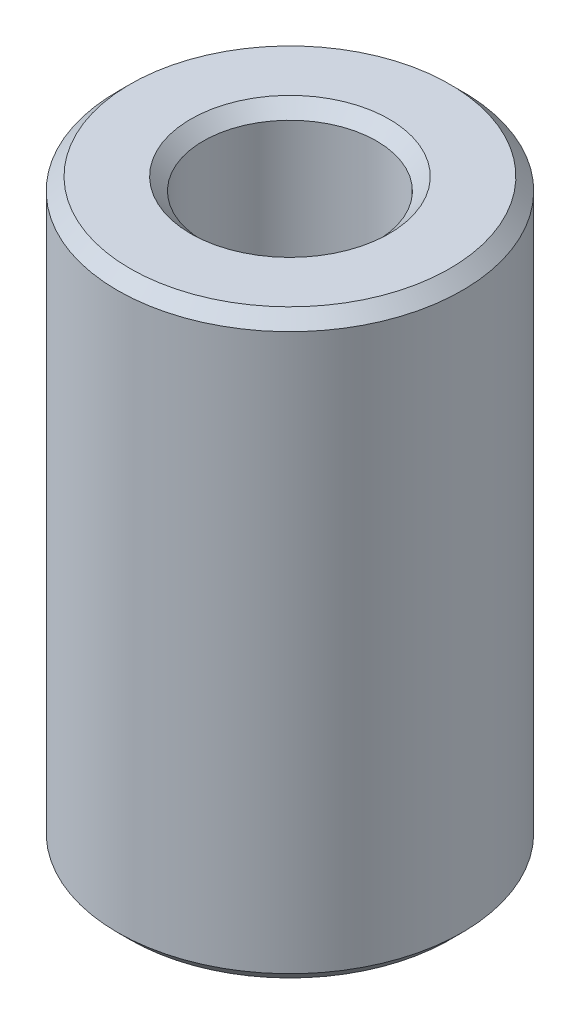
ISO-10303-21;
HEADER;
FILE_DESCRIPTION(('STEP AP214'),'2;1');
FILE_NAME('part.step','',(''),(''),'','','');
FILE_SCHEMA(('AUTOMOTIVE_DESIGN { 1 0 10303 214 1 1 1 1 }'));
ENDSEC;
DATA;
#1=APPLICATION_CONTEXT('core data for automotive mechanical design processes');
#2=APPLICATION_PROTOCOL_DEFINITION('international standard','automotive_design',2000,#1);
#3=PRODUCT_CONTEXT('',#1,'mechanical');
#4=PRODUCT('Part','Part','',(#3));
#5=PRODUCT_RELATED_PRODUCT_CATEGORY('part','',(#4));
#6=PRODUCT_DEFINITION_FORMATION('','',#4);
#7=PRODUCT_DEFINITION_CONTEXT('part definition',#1,'design');
#8=PRODUCT_DEFINITION('design','',#6,#7);
#9=PRODUCT_DEFINITION_SHAPE('','',#8);
#10=(LENGTH_UNIT() NAMED_UNIT(*) SI_UNIT(.MILLI.,.METRE.));
#11=(NAMED_UNIT(*) PLANE_ANGLE_UNIT() SI_UNIT($,.RADIAN.));
#12=(NAMED_UNIT(*) SI_UNIT($,.STERADIAN.) SOLID_ANGLE_UNIT());
#13=UNCERTAINTY_MEASURE_WITH_UNIT(LENGTH_MEASURE(1.E-05),#10,'distance_accuracy_value','');
#14=(GEOMETRIC_REPRESENTATION_CONTEXT(3) GLOBAL_UNCERTAINTY_ASSIGNED_CONTEXT((#13)) GLOBAL_UNIT_ASSIGNED_CONTEXT((#10,
#11,#12)) REPRESENTATION_CONTEXT('',''));
#15=CARTESIAN_POINT('',(0.,0.,0.));
#16=DIRECTION('',(0.,0.,1.));
#17=DIRECTION('',(1.,0.,0.));
#18=AXIS2_PLACEMENT_3D('',#15,#16,#17);
#19=CARTESIAN_POINT('',(0.,126.442121757997,0.));
#20=DIRECTION('',(0.,-1.,0.));
#21=DIRECTION('',(0.,0.,-1.));
#22=AXIS2_PLACEMENT_3D('',#19,#20,#21);
#23=CYLINDRICAL_SURFACE('',#22,37.5);
#24=CARTESIAN_POINT('',(0.,2.74460493182742,0.));
#25=DIRECTION('',(0.,1.,0.));
#26=DIRECTION('',(0.,0.,1.));
#27=AXIS2_PLACEMENT_3D('',#24,#25,#26);
#28=CIRCLE('',#27,37.5);
#29=CARTESIAN_POINT('',(0.,2.74460493182742,37.5));
#30=VERTEX_POINT('',#29);
#31=EDGE_CURVE('E10',#30,#30,#28,.T.);
#32=ORIENTED_EDGE('',*,*,#31,.T.);
#33=EDGE_LOOP('',(#32));
#34=FACE_BOUND('',#33,.T.);
#35=CARTESIAN_POINT('',(0.,123.697516826169,0.));
#36=DIRECTION('',(0.,1.,0.));
#37=DIRECTION('',(0.,0.,1.));
#38=AXIS2_PLACEMENT_3D('',#35,#36,#37);
#39=CIRCLE('',#38,37.5);
#40=CARTESIAN_POINT('',(0.,123.697516826169,37.5));
#41=VERTEX_POINT('',#40);
#42=EDGE_CURVE('E50',#41,#41,#39,.F.);
#43=ORIENTED_EDGE('',*,*,#42,.T.);
#44=EDGE_LOOP('',(#43));
#45=FACE_BOUND('',#44,.T.);
#46=ADVANCED_FACE('F39',(#34,#45),#23,.T.);
#47=CARTESIAN_POINT('',(0.,126.442121757997,0.));
#48=DIRECTION('',(0.,1.,0.));
#49=DIRECTION('',(0.,0.,1.));
#50=AXIS2_PLACEMENT_3D('',#47,#48,#49);
#51=PLANE('',#50);
#52=CARTESIAN_POINT('',(0.,126.442121757997,0.));
#53=DIRECTION('',(0.,1.,0.));
#54=DIRECTION('',(0.,0.,1.));
#55=AXIS2_PLACEMENT_3D('',#52,#53,#54);
#56=CIRCLE('',#55,21.5910273843919);
#57=CARTESIAN_POINT('',(0.,126.442121757997,21.5910273843919));
#58=VERTEX_POINT('',#57);
#59=EDGE_CURVE('E58',#58,#58,#56,.F.);
#60=ORIENTED_EDGE('',*,*,#59,.T.);
#61=EDGE_LOOP('',(#60));
#62=FACE_BOUND('',#61,.T.);
#63=CARTESIAN_POINT('',(0.,126.442121757997,0.));
#64=DIRECTION('',(0.,1.,0.));
#65=DIRECTION('',(0.,0.,1.));
#66=AXIS2_PLACEMENT_3D('',#63,#64,#65);
#67=CIRCLE('',#66,34.7553950681726);
#68=CARTESIAN_POINT('',(0.,126.442121757997,34.7553950681726));
#69=VERTEX_POINT('',#68);
#70=EDGE_CURVE('E61',#69,#69,#67,.T.);
#71=ORIENTED_EDGE('',*,*,#70,.T.);
#72=EDGE_LOOP('',(#71));
#73=FACE_BOUND('',#72,.T.);
#74=ADVANCED_FACE('F88',(#62,#73),#51,.T.);
#75=CARTESIAN_POINT('',(0.,0.,0.));
#76=DIRECTION('',(0.,1.,0.));
#77=DIRECTION('',(0.,0.,1.));
#78=AXIS2_PLACEMENT_3D('',#75,#76,#77);
#79=PLANE('',#78);
#80=CARTESIAN_POINT('',(0.,0.,0.));
#81=DIRECTION('',(0.,1.,0.));
#82=DIRECTION('',(0.,0.,1.));
#83=AXIS2_PLACEMENT_3D('',#80,#81,#82);
#84=CIRCLE('',#83,21.5910273843919);
#85=CARTESIAN_POINT('',(0.,0.,-21.5910273843919));
#86=VERTEX_POINT('',#85);
#87=EDGE_CURVE('E51',#86,#86,#84,.T.);
#88=ORIENTED_EDGE('',*,*,#87,.T.);
#89=EDGE_LOOP('',(#88));
#90=FACE_BOUND('',#89,.T.);
#91=CARTESIAN_POINT('',(0.,0.,0.));
#92=DIRECTION('',(0.,1.,0.));
#93=DIRECTION('',(0.,0.,1.));
#94=AXIS2_PLACEMENT_3D('',#91,#92,#93);
#95=CIRCLE('',#94,34.7553950681726);
#96=CARTESIAN_POINT('',(0.,0.,34.7553950681726));
#97=VERTEX_POINT('',#96);
#98=EDGE_CURVE('E54',#97,#97,#95,.F.);
#99=ORIENTED_EDGE('',*,*,#98,.T.);
#100=EDGE_LOOP('',(#99));
#101=FACE_BOUND('',#100,.T.);
#102=ADVANCED_FACE('F83',(#90,#101),#79,.F.);
#103=CARTESIAN_POINT('',(0.,126.442121757997,0.));
#104=DIRECTION('',(0.,-1.,0.));
#105=DIRECTION('',(0.,0.,-1.));
#106=AXIS2_PLACEMENT_3D('',#103,#104,#105);
#107=CYLINDRICAL_SURFACE('',#106,18.8464224525645);
#108=CARTESIAN_POINT('',(0.,123.697516826169,0.));
#109=DIRECTION('',(0.,1.,0.));
#110=DIRECTION('',(0.,0.,1.));
#111=AXIS2_PLACEMENT_3D('',#108,#109,#110);
#112=CIRCLE('',#111,18.8464224525645);
#113=CARTESIAN_POINT('',(0.,123.697516826169,18.8464224525645));
#114=VERTEX_POINT('',#113);
#115=EDGE_CURVE('E67',#114,#114,#112,.T.);
#116=ORIENTED_EDGE('',*,*,#115,.T.);
#117=EDGE_LOOP('',(#116));
#118=FACE_BOUND('',#117,.T.);
#119=CARTESIAN_POINT('',(0.,2.74460493182743,0.));
#120=DIRECTION('',(0.,1.,0.));
#121=DIRECTION('',(0.,0.,1.));
#122=AXIS2_PLACEMENT_3D('',#119,#120,#121);
#123=CIRCLE('',#122,18.8464224525645);
#124=CARTESIAN_POINT('',(0.,2.74460493182743,-18.8464224525645));
#125=VERTEX_POINT('',#124);
#126=EDGE_CURVE('E69',#125,#125,#123,.F.);
#127=ORIENTED_EDGE('',*,*,#126,.T.);
#128=EDGE_LOOP('',(#127));
#129=FACE_BOUND('',#128,.T.);
#130=ADVANCED_FACE('F71',(#118,#129),#107,.F.);
#131=CARTESIAN_POINT('',(0.,123.697516826169,0.));
#132=DIRECTION('',(0.,1.,0.));
#133=DIRECTION('',(0.,0.,1.));
#134=AXIS2_PLACEMENT_3D('',#131,#132,#133);
#135=CONICAL_SURFACE('',#134,18.8464224525645,0.785398163397449);
#136=ORIENTED_EDGE('',*,*,#59,.F.);
#137=EDGE_LOOP('',(#136));
#138=FACE_BOUND('',#137,.T.);
#139=ORIENTED_EDGE('',*,*,#115,.F.);
#140=EDGE_LOOP('',(#139));
#141=FACE_BOUND('',#140,.T.);
#142=ADVANCED_FACE('F77',(#138,#141),#135,.F.);
#143=CARTESIAN_POINT('',(0.,0.,0.));
#144=DIRECTION('',(0.,-1.,0.));
#145=DIRECTION('',(0.,0.,-1.));
#146=AXIS2_PLACEMENT_3D('',#143,#144,#145);
#147=CONICAL_SURFACE('',#146,21.5910273843919,0.785398163397446);
#148=CARTESIAN_POINT('',(0.,2.74460493182743,-18.8464224525645));
#149=CARTESIAN_POINT('',(0.,2.7160152971209,-18.875012087271));
#150=CARTESIAN_POINT('',(0.,2.68742566241436,-18.9036017219776));
#151=CARTESIAN_POINT('',(0.,2.63024639300129,-18.9607809913906));
#152=CARTESIAN_POINT('',(0.,2.60165675829475,-18.9893706260972));
#153=CARTESIAN_POINT('',(0.,2.54447748888168,-19.0465498955102));
#154=CARTESIAN_POINT('',(0.,2.51588785417515,-19.0751395302168));
#155=CARTESIAN_POINT('',(0.,2.45870858476207,-19.1323187996298));
#156=CARTESIAN_POINT('',(0.,2.43011895005554,-19.1609084343364));
#157=CARTESIAN_POINT('',(0.,2.37293968064247,-19.2180877037495));
#158=CARTESIAN_POINT('',(0.,2.34435004593593,-19.246677338456));
#159=CARTESIAN_POINT('',(0.,2.28717077652286,-19.3038566078691));
#160=CARTESIAN_POINT('',(0.,2.25858114181632,-19.3324462425756));
#161=CARTESIAN_POINT('',(0.,2.20140187240325,-19.3896255119887));
#162=CARTESIAN_POINT('',(0.,2.17281223769672,-19.4182151466952));
#163=CARTESIAN_POINT('',(0.,2.11563296828364,-19.4753944161083));
#164=CARTESIAN_POINT('',(0.,2.08704333357711,-19.5039840508148));
#165=CARTESIAN_POINT('',(0.,2.02986406416404,-19.5611633202279));
#166=CARTESIAN_POINT('',(0.,2.0012744294575,-19.5897529549344));
#167=CARTESIAN_POINT('',(0.,1.94409516004443,-19.6469322243475));
#168=CARTESIAN_POINT('',(0.,1.91550552533789,-19.675521859054));
#169=CARTESIAN_POINT('',(0.,1.85832625592482,-19.7327011284671));
#170=CARTESIAN_POINT('',(0.,1.82973662121829,-19.7612907631736));
#171=CARTESIAN_POINT('',(0.,1.77255735180522,-19.8184700325867));
#172=CARTESIAN_POINT('',(0.,1.74396771709868,-19.8470596672932));
#173=CARTESIAN_POINT('',(0.,1.68678844768561,-19.9042389367063));
#174=CARTESIAN_POINT('',(0.,1.65819881297907,-19.9328285714128));
#175=CARTESIAN_POINT('',(0.,1.601019543566,-19.9900078408259));
#176=CARTESIAN_POINT('',(0.,1.57242990885947,-20.0185974755324));
#177=CARTESIAN_POINT('',(0.,1.51525063944639,-20.0757767449455));
#178=CARTESIAN_POINT('',(0.,1.48666100473986,-20.1043663796521));
#179=CARTESIAN_POINT('',(0.,1.42948173532679,-20.1615456490651));
#180=CARTESIAN_POINT('',(0.,1.40089210062025,-20.1901352837717));
#181=CARTESIAN_POINT('',(0.,1.34371283120718,-20.2473145531847));
#182=CARTESIAN_POINT('',(0.,1.31512319650064,-20.2759041878913));
#183=CARTESIAN_POINT('',(0.,1.25794392708757,-20.3330834573043));
#184=CARTESIAN_POINT('',(0.,1.22935429238104,-20.3616730920109));
#185=CARTESIAN_POINT('',(0.,1.17217502296797,-20.4188523614239));
#186=CARTESIAN_POINT('',(0.,1.14358538826143,-20.4474419961305));
#187=CARTESIAN_POINT('',(0.,1.08640611884836,-20.5046212655436));
#188=CARTESIAN_POINT('',(0.,1.05781648414182,-20.5332109002501));
#189=CARTESIAN_POINT('',(0.,1.00063721472875,-20.5903901696632));
#190=CARTESIAN_POINT('',(0.,0.972047580022216,-20.6189798043697));
#191=CARTESIAN_POINT('',(0.,0.914868310609144,-20.6761590737828));
#192=CARTESIAN_POINT('',(0.,0.886278675902609,-20.7047487084893));
#193=CARTESIAN_POINT('',(0.,0.829099406489537,-20.7619279779024));
#194=CARTESIAN_POINT('',(0.,0.800509771783001,-20.7905176126089));
#195=CARTESIAN_POINT('',(0.,0.743330502369929,-20.847696882022));
#196=CARTESIAN_POINT('',(0.,0.714740867663394,-20.8762865167285));
#197=CARTESIAN_POINT('',(0.,0.657561598250323,-20.9334657861416));
#198=CARTESIAN_POINT('',(0.,0.628971963543786,-20.9620554208481));
#199=CARTESIAN_POINT('',(0.,0.571792694130715,-21.0192346902612));
#200=CARTESIAN_POINT('',(0.,0.543203059424179,-21.0478243249677));
#201=CARTESIAN_POINT('',(0.,0.486023790011108,-21.1050035943808));
#202=CARTESIAN_POINT('',(0.,0.457434155304572,-21.1335932290873));
#203=CARTESIAN_POINT('',(0.,0.4002548858915,-21.1907724985004));
#204=CARTESIAN_POINT('',(0.,0.371665251184964,-21.2193621332069));
#205=CARTESIAN_POINT('',(0.,0.314485981771893,-21.27654140262));
#206=CARTESIAN_POINT('',(0.,0.285896347065358,-21.3051310373266));
#207=CARTESIAN_POINT('',(0.,0.228717077652286,-21.3623103067396));
#208=CARTESIAN_POINT('',(0.,0.20012744294575,-21.3908999414462));
#209=CARTESIAN_POINT('',(0.,0.142948173532678,-21.4480792108592));
#210=CARTESIAN_POINT('',(0.,0.114358538826143,-21.4766688455658));
#211=CARTESIAN_POINT('',(0.,0.0571792694130721,-21.5338481149788));
#212=CARTESIAN_POINT('',(0.,0.0285896347065367,-21.5624377496854));
#213=CARTESIAN_POINT('',(0.,0.,-21.5910273843919));
#214=B_SPLINE_CURVE_WITH_KNOTS('',3,(#148,#149,#150,#151,#152,#153,#154,#155,#156,#157,#158,
#159,#160,#161,#162,#163,#164,#165,#166,#167,#168,#169,#170,#171,#172,#173,#174,#175,#176,#177,
#178,#179,#180,#181,#182,#183,#184,#185,#186,#187,#188,#189,#190,#191,#192,#193,#194,#195,#196,
#197,#198,#199,#200,#201,#202,#203,#204,#205,#206,#207,#208,#209,#210,#211,#212,#213),
.UNSPECIFIED.,.F.,.F.,(4,2,2,2,2,2,2,2,2,2,2,2,2,2,2,2,2,2,2,2,2,2,2,2,2,2,2,2,2,2,2,2,4),(0.,
0.121295547435827,0.242591094871652,0.363886642307477,0.485182189743305,0.60647773717913,
0.727773284614957,0.849068832050782,0.970364379486607,1.09165992692243,1.21295547435826,
1.33425102179409,1.45554656922991,1.57684211666574,1.69813766410156,1.81943321153739,
1.94072875897322,2.06202430640904,2.18331985384487,2.30461540128069,2.42591094871652,
2.54720649615235,2.66850204358817,2.789797591024,2.91109313845982,3.03238868589565,
3.15368423333148,3.2749797807673,3.39627532820313,3.51757087563895,3.63886642307478,
3.76016197051061,3.88145751794643),.UNSPECIFIED.);
#215=EDGE_CURVE('BSEAM73',#125,#86,#214,.T.);
#216=ORIENTED_EDGE('',*,*,#126,.F.);
#217=ORIENTED_EDGE('',*,*,#87,.F.);
#218=ORIENTED_EDGE('',*,*,#215,.T.);
#219=ORIENTED_EDGE('',*,*,#215,.F.);
#220=EDGE_LOOP('',(#216,#218,#217,#219));
#221=FACE_BOUND('',#220,.T.);
#222=ADVANCED_FACE('F73',(#221),#147,.F.);
#223=CARTESIAN_POINT('',(0.,2.74460493182742,0.));
#224=DIRECTION('',(0.,1.,0.));
#225=DIRECTION('',(0.,0.,1.));
#226=AXIS2_PLACEMENT_3D('',#223,#224,#225);
#227=CONICAL_SURFACE('',#226,37.5,0.785398163397451);
#228=ORIENTED_EDGE('',*,*,#98,.F.);
#229=EDGE_LOOP('',(#228));
#230=FACE_BOUND('',#229,.T.);
#231=ORIENTED_EDGE('',*,*,#31,.F.);
#232=EDGE_LOOP('',(#231));
#233=FACE_BOUND('',#232,.T.);
#234=ADVANCED_FACE('F76',(#230,#233),#227,.T.);
#235=CARTESIAN_POINT('',(0.,126.442121757997,0.));
#236=DIRECTION('',(0.,-1.,0.));
#237=DIRECTION('',(0.,0.,-1.));
#238=AXIS2_PLACEMENT_3D('',#235,#236,#237);
#239=CONICAL_SURFACE('',#238,34.7553950681726,0.785398163397441);
#240=ORIENTED_EDGE('',*,*,#42,.F.);
#241=EDGE_LOOP('',(#240));
#242=FACE_BOUND('',#241,.T.);
#243=ORIENTED_EDGE('',*,*,#70,.F.);
#244=EDGE_LOOP('',(#243));
#245=FACE_BOUND('',#244,.T.);
#246=ADVANCED_FACE('F45',(#242,#245),#239,.T.);
#247=CLOSED_SHELL('',(#46,#74,#102,#130,#142,#222,#234,#246));
#248=MANIFOLD_SOLID_BREP('B2',#247);
#249=ADVANCED_BREP_SHAPE_REPRESENTATION('',(#18,#248),#14);
#250=SHAPE_DEFINITION_REPRESENTATION(#9,#249);
ENDSEC;
END-ISO-10303-21;
